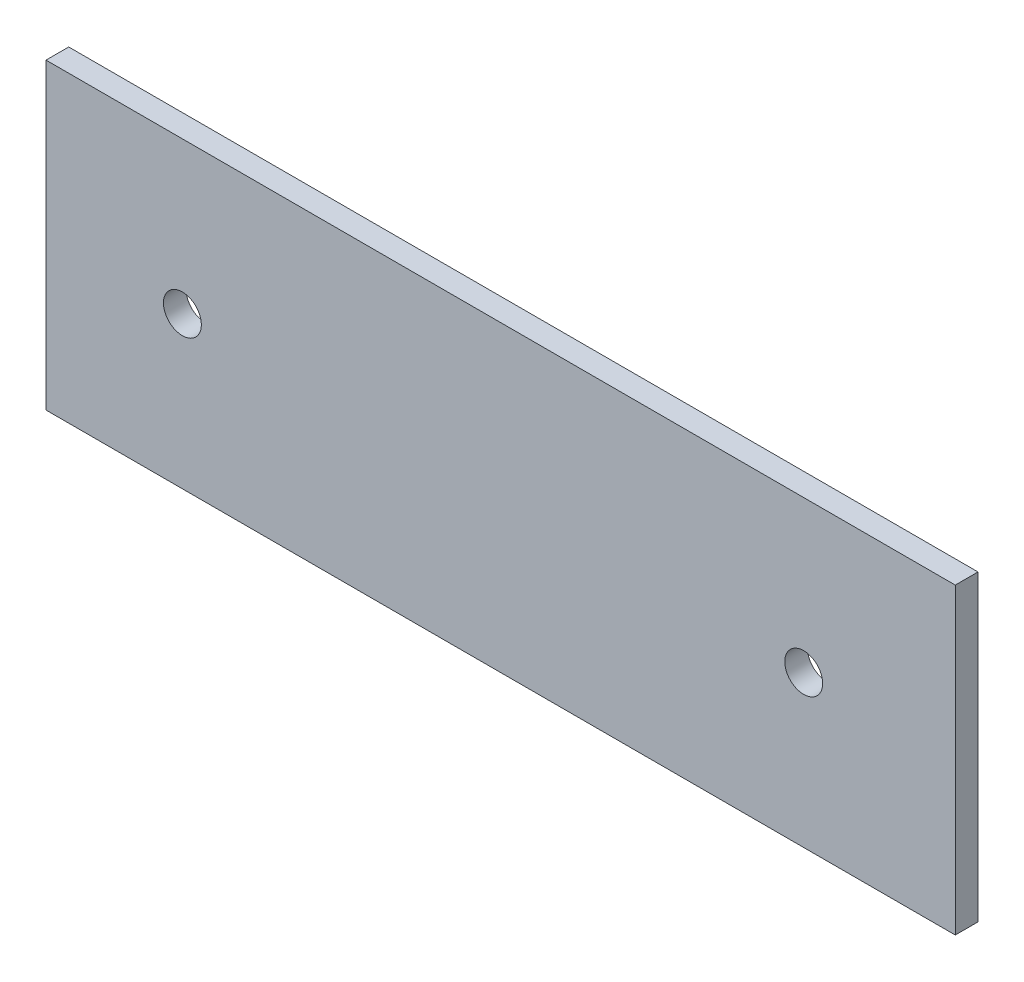
ISO-10303-21;
HEADER;
FILE_DESCRIPTION(('STEP AP214'),'2;1');
FILE_NAME('part.step','',(''),(''),'','','');
FILE_SCHEMA(('AUTOMOTIVE_DESIGN { 1 0 10303 214 1 1 1 1 }'));
ENDSEC;
DATA;
#1=APPLICATION_CONTEXT('core data for automotive mechanical design processes');
#2=APPLICATION_PROTOCOL_DEFINITION('international standard','automotive_design',2000,#1);
#3=PRODUCT_CONTEXT('',#1,'mechanical');
#4=PRODUCT('Part','Part','',(#3));
#5=PRODUCT_RELATED_PRODUCT_CATEGORY('part','',(#4));
#6=PRODUCT_DEFINITION_FORMATION('','',#4);
#7=PRODUCT_DEFINITION_CONTEXT('part definition',#1,'design');
#8=PRODUCT_DEFINITION('design','',#6,#7);
#9=PRODUCT_DEFINITION_SHAPE('','',#8);
#10=(LENGTH_UNIT() NAMED_UNIT(*) SI_UNIT(.MILLI.,.METRE.));
#11=(NAMED_UNIT(*) PLANE_ANGLE_UNIT() SI_UNIT($,.RADIAN.));
#12=(NAMED_UNIT(*) SI_UNIT($,.STERADIAN.) SOLID_ANGLE_UNIT());
#13=UNCERTAINTY_MEASURE_WITH_UNIT(LENGTH_MEASURE(1.E-05),#10,'distance_accuracy_value','');
#14=(GEOMETRIC_REPRESENTATION_CONTEXT(3) GLOBAL_UNCERTAINTY_ASSIGNED_CONTEXT((#13)) GLOBAL_UNIT_ASSIGNED_CONTEXT((#10,
#11,#12)) REPRESENTATION_CONTEXT('',''));
#15=CARTESIAN_POINT('',(0.,0.,0.));
#16=DIRECTION('',(0.,0.,1.));
#17=DIRECTION('',(1.,0.,0.));
#18=AXIS2_PLACEMENT_3D('',#15,#16,#17);
#19=CARTESIAN_POINT('',(0.,0.,3.));
#20=DIRECTION('',(1.,0.,0.));
#21=DIRECTION('',(0.,1.,0.));
#22=AXIS2_PLACEMENT_3D('',#19,#20,#21);
#23=PLANE('',#22);
#24=DIRECTION('',(0.,-1.,0.));
#25=VECTOR('',#24,1.);
#26=CARTESIAN_POINT('',(0.,0.,0.));
#27=LINE('',#26,#25);
#28=CARTESIAN_POINT('',(0.,0.,0.));
#29=VERTEX_POINT('',#28);
#30=CARTESIAN_POINT('',(0.,-40.,0.));
#31=VERTEX_POINT('',#30);
#32=EDGE_CURVE('E95',#29,#31,#27,.T.);
#33=ORIENTED_EDGE('',*,*,#32,.T.);
#34=DIRECTION('',(0.,0.,-1.));
#35=VECTOR('',#34,1.);
#36=CARTESIAN_POINT('',(0.,-40.,3.));
#37=LINE('',#36,#35);
#38=CARTESIAN_POINT('',(0.,-40.,3.));
#39=VERTEX_POINT('',#38);
#40=EDGE_CURVE('E11',#39,#31,#37,.T.);
#41=ORIENTED_EDGE('',*,*,#40,.F.);
#42=DIRECTION('',(0.,-1.,0.));
#43=VECTOR('',#42,1.);
#44=CARTESIAN_POINT('',(0.,0.,3.));
#45=LINE('',#44,#43);
#46=CARTESIAN_POINT('',(0.,0.,3.));
#47=VERTEX_POINT('',#46);
#48=EDGE_CURVE('E83',#47,#39,#45,.T.);
#49=ORIENTED_EDGE('',*,*,#48,.F.);
#50=DIRECTION('',(0.,0.,-1.));
#51=VECTOR('',#50,1.);
#52=CARTESIAN_POINT('',(0.,0.,3.));
#53=LINE('',#52,#51);
#54=EDGE_CURVE('E91',#47,#29,#53,.T.);
#55=ORIENTED_EDGE('',*,*,#54,.T.);
#56=EDGE_LOOP('',(#33,#41,#49,#55));
#57=FACE_BOUND('',#56,.T.);
#58=ADVANCED_FACE('F32',(#57),#23,.F.);
#59=CARTESIAN_POINT('',(0.,-40.,3.));
#60=DIRECTION('',(0.,1.,0.));
#61=DIRECTION('',(-1.,0.,0.));
#62=AXIS2_PLACEMENT_3D('',#59,#60,#61);
#63=PLANE('',#62);
#64=DIRECTION('',(1.,0.,0.));
#65=VECTOR('',#64,1.);
#66=CARTESIAN_POINT('',(0.,-40.,0.));
#67=LINE('',#66,#65);
#68=CARTESIAN_POINT('',(120.,-40.,0.));
#69=VERTEX_POINT('',#68);
#70=EDGE_CURVE('E87',#31,#69,#67,.T.);
#71=ORIENTED_EDGE('',*,*,#70,.T.);
#72=DIRECTION('',(0.,0.,-1.));
#73=VECTOR('',#72,1.);
#74=CARTESIAN_POINT('',(120.,-40.,3.));
#75=LINE('',#74,#73);
#76=CARTESIAN_POINT('',(120.,-40.,3.));
#77=VERTEX_POINT('',#76);
#78=EDGE_CURVE('E40',#77,#69,#75,.T.);
#79=ORIENTED_EDGE('',*,*,#78,.F.);
#80=DIRECTION('',(1.,0.,0.));
#81=VECTOR('',#80,1.);
#82=CARTESIAN_POINT('',(0.,-40.,3.));
#83=LINE('',#82,#81);
#84=EDGE_CURVE('E78',#39,#77,#83,.T.);
#85=ORIENTED_EDGE('',*,*,#84,.F.);
#86=ORIENTED_EDGE('',*,*,#40,.T.);
#87=EDGE_LOOP('',(#71,#79,#85,#86));
#88=FACE_BOUND('',#87,.T.);
#89=ADVANCED_FACE('F86',(#88),#63,.F.);
#90=CARTESIAN_POINT('',(120.,0.,3.));
#91=DIRECTION('',(-1.,0.,0.));
#92=DIRECTION('',(0.,0.,1.));
#93=AXIS2_PLACEMENT_3D('',#90,#91,#92);
#94=PLANE('',#93);
#95=DIRECTION('',(0.,1.,0.));
#96=VECTOR('',#95,1.);
#97=CARTESIAN_POINT('',(120.,0.,0.));
#98=LINE('',#97,#96);
#99=CARTESIAN_POINT('',(120.,0.,0.));
#100=VERTEX_POINT('',#99);
#101=EDGE_CURVE('E65',#69,#100,#98,.T.);
#102=ORIENTED_EDGE('',*,*,#101,.T.);
#103=DIRECTION('',(0.,0.,-1.));
#104=VECTOR('',#103,1.);
#105=CARTESIAN_POINT('',(120.,0.,3.));
#106=LINE('',#105,#104);
#107=CARTESIAN_POINT('',(120.,0.,3.));
#108=VERTEX_POINT('',#107);
#109=EDGE_CURVE('E88',#108,#100,#106,.T.);
#110=ORIENTED_EDGE('',*,*,#109,.F.);
#111=DIRECTION('',(0.,1.,0.));
#112=VECTOR('',#111,1.);
#113=CARTESIAN_POINT('',(120.,0.,3.));
#114=LINE('',#113,#112);
#115=EDGE_CURVE('E81',#77,#108,#114,.T.);
#116=ORIENTED_EDGE('',*,*,#115,.F.);
#117=ORIENTED_EDGE('',*,*,#78,.T.);
#118=EDGE_LOOP('',(#102,#110,#116,#117));
#119=FACE_BOUND('',#118,.T.);
#120=ADVANCED_FACE('F89',(#119),#94,.F.);
#121=CARTESIAN_POINT('',(0.,0.,3.));
#122=DIRECTION('',(0.,-1.,0.));
#123=DIRECTION('',(0.,0.,-1.));
#124=AXIS2_PLACEMENT_3D('',#121,#122,#123);
#125=PLANE('',#124);
#126=DIRECTION('',(-1.,0.,0.));
#127=VECTOR('',#126,1.);
#128=CARTESIAN_POINT('',(0.,0.,0.));
#129=LINE('',#128,#127);
#130=EDGE_CURVE('E71',#100,#29,#129,.T.);
#131=ORIENTED_EDGE('',*,*,#130,.T.);
#132=ORIENTED_EDGE('',*,*,#54,.F.);
#133=DIRECTION('',(-1.,0.,0.));
#134=VECTOR('',#133,1.);
#135=CARTESIAN_POINT('',(0.,0.,3.));
#136=LINE('',#135,#134);
#137=EDGE_CURVE('E48',#108,#47,#136,.T.);
#138=ORIENTED_EDGE('',*,*,#137,.F.);
#139=ORIENTED_EDGE('',*,*,#109,.T.);
#140=EDGE_LOOP('',(#131,#132,#138,#139));
#141=FACE_BOUND('',#140,.T.);
#142=ADVANCED_FACE('F103',(#141),#125,.F.);
#143=CARTESIAN_POINT('',(0.,0.,3.));
#144=DIRECTION('',(0.,0.,1.));
#145=DIRECTION('',(1.,0.,0.));
#146=AXIS2_PLACEMENT_3D('',#143,#144,#145);
#147=PLANE('',#146);
#148=CARTESIAN_POINT('',(100.,-20.,3.));
#149=DIRECTION('',(0.,0.,1.));
#150=DIRECTION('',(1.,0.,0.));
#151=AXIS2_PLACEMENT_3D('',#148,#149,#150);
#152=CIRCLE('',#151,2.49999999999999);
#153=CARTESIAN_POINT('',(102.5,-20.,3.));
#154=VERTEX_POINT('',#153);
#155=EDGE_CURVE('E115',#154,#154,#152,.T.);
#156=ORIENTED_EDGE('',*,*,#155,.F.);
#157=EDGE_LOOP('',(#156));
#158=FACE_BOUND('',#157,.T.);
#159=CARTESIAN_POINT('',(18.,-20.,3.));
#160=DIRECTION('',(0.,0.,1.));
#161=DIRECTION('',(1.,0.,0.));
#162=AXIS2_PLACEMENT_3D('',#159,#160,#161);
#163=CIRCLE('',#162,2.5);
#164=CARTESIAN_POINT('',(20.5,-20.,3.));
#165=VERTEX_POINT('',#164);
#166=EDGE_CURVE('E109',#165,#165,#163,.T.);
#167=ORIENTED_EDGE('',*,*,#166,.F.);
#168=EDGE_LOOP('',(#167));
#169=FACE_BOUND('',#168,.T.);
#170=ORIENTED_EDGE('',*,*,#48,.T.);
#171=ORIENTED_EDGE('',*,*,#84,.T.);
#172=ORIENTED_EDGE('',*,*,#115,.T.);
#173=ORIENTED_EDGE('',*,*,#137,.T.);
#174=EDGE_LOOP('',(#170,#171,#172,#173));
#175=FACE_BOUND('',#174,.T.);
#176=ADVANCED_FACE('F79',(#158,#169,#175),#147,.T.);
#177=CARTESIAN_POINT('',(0.,0.,0.));
#178=DIRECTION('',(0.,0.,1.));
#179=DIRECTION('',(1.,0.,0.));
#180=AXIS2_PLACEMENT_3D('',#177,#178,#179);
#181=PLANE('',#180);
#182=CARTESIAN_POINT('',(100.,-20.,0.));
#183=DIRECTION('',(0.,0.,1.));
#184=DIRECTION('',(1.,0.,0.));
#185=AXIS2_PLACEMENT_3D('',#182,#183,#184);
#186=CIRCLE('',#185,2.49999999999999);
#187=CARTESIAN_POINT('',(102.5,-20.,0.));
#188=VERTEX_POINT('',#187);
#189=EDGE_CURVE('E112',#188,#188,#186,.T.);
#190=ORIENTED_EDGE('',*,*,#189,.T.);
#191=EDGE_LOOP('',(#190));
#192=FACE_BOUND('',#191,.T.);
#193=CARTESIAN_POINT('',(18.,-20.,0.));
#194=DIRECTION('',(0.,0.,1.));
#195=DIRECTION('',(1.,0.,0.));
#196=AXIS2_PLACEMENT_3D('',#193,#194,#195);
#197=CIRCLE('',#196,2.5);
#198=CARTESIAN_POINT('',(20.5,-20.,0.));
#199=VERTEX_POINT('',#198);
#200=EDGE_CURVE('E98',#199,#199,#197,.T.);
#201=ORIENTED_EDGE('',*,*,#200,.T.);
#202=EDGE_LOOP('',(#201));
#203=FACE_BOUND('',#202,.T.);
#204=ORIENTED_EDGE('',*,*,#32,.F.);
#205=ORIENTED_EDGE('',*,*,#130,.F.);
#206=ORIENTED_EDGE('',*,*,#101,.F.);
#207=ORIENTED_EDGE('',*,*,#70,.F.);
#208=EDGE_LOOP('',(#204,#205,#206,#207));
#209=FACE_BOUND('',#208,.T.);
#210=ADVANCED_FACE('F106',(#192,#203,#209),#181,.F.);
#211=CARTESIAN_POINT('',(18.,-20.,0.));
#212=DIRECTION('',(0.,0.,1.));
#213=DIRECTION('',(1.,0.,0.));
#214=AXIS2_PLACEMENT_3D('',#211,#212,#213);
#215=CYLINDRICAL_SURFACE('',#214,2.5);
#216=ORIENTED_EDGE('',*,*,#200,.F.);
#217=EDGE_LOOP('',(#216));
#218=FACE_BOUND('',#217,.T.);
#219=ORIENTED_EDGE('',*,*,#166,.T.);
#220=EDGE_LOOP('',(#219));
#221=FACE_BOUND('',#220,.T.);
#222=ADVANCED_FACE('F126',(#218,#221),#215,.F.);
#223=CARTESIAN_POINT('',(100.,-20.,0.));
#224=DIRECTION('',(0.,0.,1.));
#225=DIRECTION('',(1.,0.,0.));
#226=AXIS2_PLACEMENT_3D('',#223,#224,#225);
#227=CYLINDRICAL_SURFACE('',#226,2.49999999999999);
#228=ORIENTED_EDGE('',*,*,#189,.F.);
#229=EDGE_LOOP('',(#228));
#230=FACE_BOUND('',#229,.T.);
#231=ORIENTED_EDGE('',*,*,#155,.T.);
#232=EDGE_LOOP('',(#231));
#233=FACE_BOUND('',#232,.T.);
#234=ADVANCED_FACE('F123',(#230,#233),#227,.F.);
#235=CLOSED_SHELL('',(#58,#89,#120,#142,#176,#210,#222,#234));
#236=MANIFOLD_SOLID_BREP('B2',#235);
#237=ADVANCED_BREP_SHAPE_REPRESENTATION('',(#18,#236),#14);
#238=SHAPE_DEFINITION_REPRESENTATION(#9,#237);
ENDSEC;
END-ISO-10303-21;
